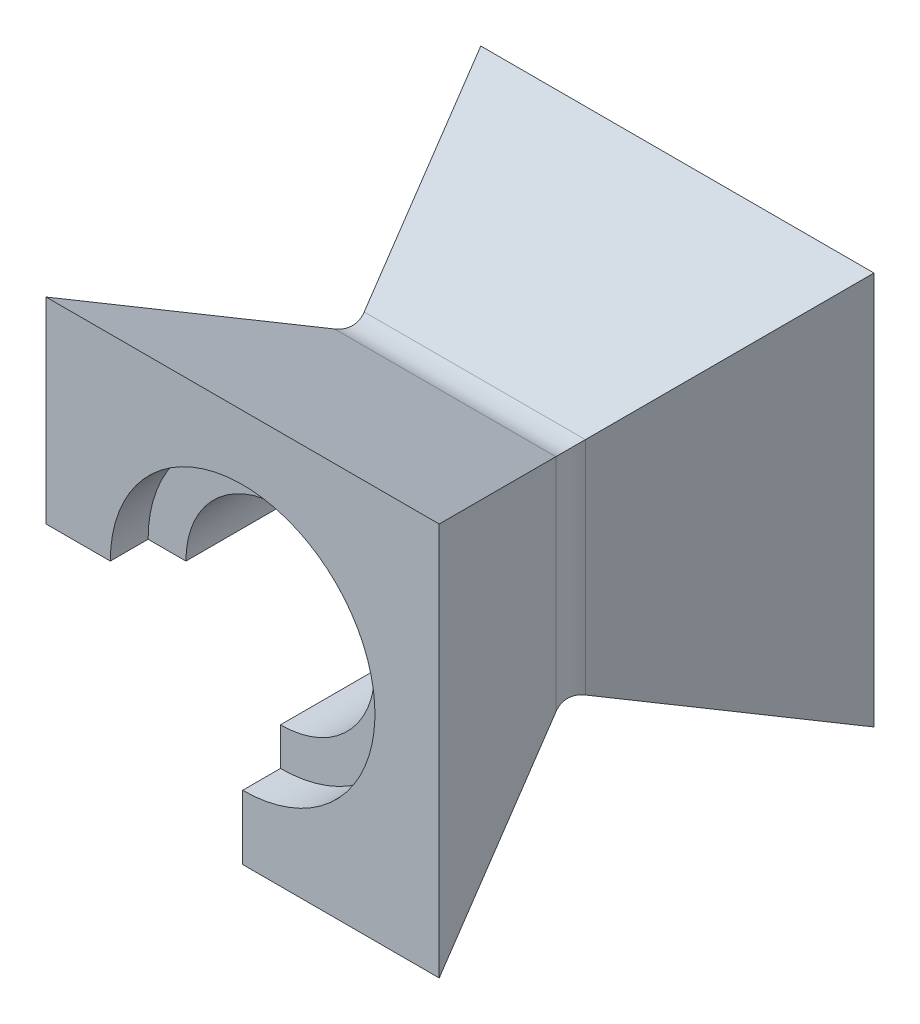
ISO-10303-21;
HEADER;
FILE_DESCRIPTION(('STEP AP214'),'2;1');
FILE_NAME('part.step','',(''),(''),'','','');
FILE_SCHEMA(('AUTOMOTIVE_DESIGN { 1 0 10303 214 1 1 1 1 }'));
ENDSEC;
DATA;
#1=APPLICATION_CONTEXT('core data for automotive mechanical design processes');
#2=APPLICATION_PROTOCOL_DEFINITION('international standard','automotive_design',2000,#1);
#3=PRODUCT_CONTEXT('',#1,'mechanical');
#4=PRODUCT('Part','Part','',(#3));
#5=PRODUCT_RELATED_PRODUCT_CATEGORY('part','',(#4));
#6=PRODUCT_DEFINITION_FORMATION('','',#4);
#7=PRODUCT_DEFINITION_CONTEXT('part definition',#1,'design');
#8=PRODUCT_DEFINITION('design','',#6,#7);
#9=PRODUCT_DEFINITION_SHAPE('','',#8);
#10=(LENGTH_UNIT() NAMED_UNIT(*) SI_UNIT(.MILLI.,.METRE.));
#11=(NAMED_UNIT(*) PLANE_ANGLE_UNIT() SI_UNIT($,.RADIAN.));
#12=(NAMED_UNIT(*) SI_UNIT($,.STERADIAN.) SOLID_ANGLE_UNIT());
#13=UNCERTAINTY_MEASURE_WITH_UNIT(LENGTH_MEASURE(1.E-05),#10,'distance_accuracy_value','');
#14=(GEOMETRIC_REPRESENTATION_CONTEXT(3) GLOBAL_UNCERTAINTY_ASSIGNED_CONTEXT((#13)) GLOBAL_UNIT_ASSIGNED_CONTEXT((#10,
#11,#12)) REPRESENTATION_CONTEXT('',''));
#15=CARTESIAN_POINT('',(0.,0.,0.));
#16=DIRECTION('',(0.,0.,1.));
#17=DIRECTION('',(1.,0.,0.));
#18=AXIS2_PLACEMENT_3D('',#15,#16,#17);
#19=CARTESIAN_POINT('',(0.,0.,115.));
#20=DIRECTION('',(0.,0.,-1.));
#21=DIRECTION('',(-1.,0.,0.));
#22=AXIS2_PLACEMENT_3D('',#19,#20,#21);
#23=CYLINDRICAL_SURFACE('',#22,25.);
#24=DIRECTION('',(0.,0.,-1.));
#25=VECTOR('',#24,1.);
#26=CARTESIAN_POINT('',(-25.,0.,115.));
#27=LINE('',#26,#25);
#28=CARTESIAN_POINT('',(-25.,0.,9.99999999999999));
#29=VERTEX_POINT('',#28);
#30=CARTESIAN_POINT('',(-25.,0.,105.));
#31=VERTEX_POINT('',#30);
#32=EDGE_CURVE('E196',#29,#31,#27,.F.);
#33=ORIENTED_EDGE('',*,*,#32,.F.);
#34=CARTESIAN_POINT('',(0.,0.,9.99999999999999));
#35=DIRECTION('',(0.,0.,-1.));
#36=DIRECTION('',(-1.,0.,0.));
#37=AXIS2_PLACEMENT_3D('',#34,#35,#36);
#38=CIRCLE('',#37,25.);
#39=CARTESIAN_POINT('',(0.,-25.,9.99999999999999));
#40=VERTEX_POINT('',#39);
#41=EDGE_CURVE('E317',#29,#40,#38,.T.);
#42=ORIENTED_EDGE('',*,*,#41,.T.);
#43=DIRECTION('',(0.,0.,-1.));
#44=VECTOR('',#43,1.);
#45=CARTESIAN_POINT('',(0.,-25.,115.));
#46=LINE('',#45,#44);
#47=CARTESIAN_POINT('',(0.,-25.,105.));
#48=VERTEX_POINT('',#47);
#49=EDGE_CURVE('E203',#48,#40,#46,.T.);
#50=ORIENTED_EDGE('',*,*,#49,.F.);
#51=CARTESIAN_POINT('',(0.,0.,105.));
#52=DIRECTION('',(0.,0.,1.));
#53=DIRECTION('',(1.,0.,0.));
#54=AXIS2_PLACEMENT_3D('',#51,#52,#53);
#55=CIRCLE('',#54,25.);
#56=EDGE_CURVE('E68',#48,#31,#55,.T.);
#57=ORIENTED_EDGE('',*,*,#56,.T.);
#58=EDGE_LOOP('',(#33,#42,#50,#57));
#59=FACE_BOUND('',#58,.T.);
#60=ADVANCED_FACE('F44',(#59),#23,.F.);
#61=CARTESIAN_POINT('',(0.,0.,115.));
#62=DIRECTION('',(0.,0.,1.));
#63=DIRECTION('',(1.,0.,0.));
#64=AXIS2_PLACEMENT_3D('',#61,#62,#63);
#65=PLANE('',#64);
#66=CARTESIAN_POINT('',(0.,0.,115.));
#67=DIRECTION('',(0.,0.,1.));
#68=DIRECTION('',(1.,0.,0.));
#69=AXIS2_PLACEMENT_3D('',#66,#67,#68);
#70=CIRCLE('',#69,35.);
#71=CARTESIAN_POINT('',(0.,-35.,115.));
#72=VERTEX_POINT('',#71);
#73=CARTESIAN_POINT('',(-35.,0.,115.));
#74=VERTEX_POINT('',#73);
#75=EDGE_CURVE('E166',#72,#74,#70,.T.);
#76=ORIENTED_EDGE('',*,*,#75,.F.);
#77=DIRECTION('',(0.,-1.,0.));
#78=VECTOR('',#77,1.);
#79=CARTESIAN_POINT('',(0.,-61.3662230104889,115.));
#80=LINE('',#79,#78);
#81=CARTESIAN_POINT('',(0.,-52.,115.));
#82=VERTEX_POINT('',#81);
#83=EDGE_CURVE('E184',#72,#82,#80,.T.);
#84=ORIENTED_EDGE('',*,*,#83,.T.);
#85=DIRECTION('',(1.,0.,0.));
#86=VECTOR('',#85,1.);
#87=CARTESIAN_POINT('',(52.,-52.,115.));
#88=LINE('',#87,#86);
#89=CARTESIAN_POINT('',(52.,-52.,115.));
#90=VERTEX_POINT('',#89);
#91=EDGE_CURVE('E226',#82,#90,#88,.T.);
#92=ORIENTED_EDGE('',*,*,#91,.T.);
#93=DIRECTION('',(0.,1.,0.));
#94=VECTOR('',#93,1.);
#95=CARTESIAN_POINT('',(52.,-52.,115.));
#96=LINE('',#95,#94);
#97=CARTESIAN_POINT('',(52.,52.,115.));
#98=VERTEX_POINT('',#97);
#99=EDGE_CURVE('E231',#90,#98,#96,.T.);
#100=ORIENTED_EDGE('',*,*,#99,.T.);
#101=DIRECTION('',(-1.,0.,0.));
#102=VECTOR('',#101,1.);
#103=CARTESIAN_POINT('',(52.,52.,115.));
#104=LINE('',#103,#102);
#105=CARTESIAN_POINT('',(-52.,52.,115.));
#106=VERTEX_POINT('',#105);
#107=EDGE_CURVE('E235',#98,#106,#104,.T.);
#108=ORIENTED_EDGE('',*,*,#107,.T.);
#109=DIRECTION('',(0.,-1.,0.));
#110=VECTOR('',#109,1.);
#111=CARTESIAN_POINT('',(-52.,-52.,115.));
#112=LINE('',#111,#110);
#113=CARTESIAN_POINT('',(-52.,0.,115.));
#114=VERTEX_POINT('',#113);
#115=EDGE_CURVE('E222',#106,#114,#112,.T.);
#116=ORIENTED_EDGE('',*,*,#115,.T.);
#117=DIRECTION('',(1.,0.,0.));
#118=VECTOR('',#117,1.);
#119=CARTESIAN_POINT('',(0.,0.,115.));
#120=LINE('',#119,#118);
#121=EDGE_CURVE('E188',#114,#74,#120,.T.);
#122=ORIENTED_EDGE('',*,*,#121,.T.);
#123=EDGE_LOOP('',(#76,#84,#92,#100,#108,#116,#122));
#124=FACE_BOUND('',#123,.T.);
#125=ADVANCED_FACE('F351',(#124),#65,.T.);
#126=CARTESIAN_POINT('',(0.,0.,0.));
#127=DIRECTION('',(0.,0.,1.));
#128=DIRECTION('',(1.,0.,0.));
#129=AXIS2_PLACEMENT_3D('',#126,#127,#128);
#130=PLANE('',#129);
#131=DIRECTION('',(0.,-1.,0.));
#132=VECTOR('',#131,1.);
#133=CARTESIAN_POINT('',(0.,-61.3662230104889,0.));
#134=LINE('',#133,#132);
#135=CARTESIAN_POINT('',(0.,-35.,0.));
#136=VERTEX_POINT('',#135);
#137=CARTESIAN_POINT('',(0.,-52.,0.));
#138=VERTEX_POINT('',#137);
#139=EDGE_CURVE('E177',#136,#138,#134,.T.);
#140=ORIENTED_EDGE('',*,*,#139,.F.);
#141=CARTESIAN_POINT('',(0.,0.,0.));
#142=DIRECTION('',(0.,0.,-1.));
#143=DIRECTION('',(-1.,0.,0.));
#144=AXIS2_PLACEMENT_3D('',#141,#142,#143);
#145=CIRCLE('',#144,35.);
#146=CARTESIAN_POINT('',(-35.,0.,0.));
#147=VERTEX_POINT('',#146);
#148=EDGE_CURVE('E161',#147,#136,#145,.T.);
#149=ORIENTED_EDGE('',*,*,#148,.F.);
#150=DIRECTION('',(1.,0.,0.));
#151=VECTOR('',#150,1.);
#152=CARTESIAN_POINT('',(0.,0.,0.));
#153=LINE('',#152,#151);
#154=CARTESIAN_POINT('',(-52.,0.,0.));
#155=VERTEX_POINT('',#154);
#156=EDGE_CURVE('E174',#155,#147,#153,.T.);
#157=ORIENTED_EDGE('',*,*,#156,.F.);
#158=DIRECTION('',(0.,-1.,0.));
#159=VECTOR('',#158,1.);
#160=CARTESIAN_POINT('',(-52.,-52.,0.));
#161=LINE('',#160,#159);
#162=CARTESIAN_POINT('',(-52.,52.,0.));
#163=VERTEX_POINT('',#162);
#164=EDGE_CURVE('E221',#163,#155,#161,.T.);
#165=ORIENTED_EDGE('',*,*,#164,.F.);
#166=DIRECTION('',(-1.,0.,0.));
#167=VECTOR('',#166,1.);
#168=CARTESIAN_POINT('',(52.,52.,0.));
#169=LINE('',#168,#167);
#170=CARTESIAN_POINT('',(52.,52.,0.));
#171=VERTEX_POINT('',#170);
#172=EDGE_CURVE('E227',#171,#163,#169,.T.);
#173=ORIENTED_EDGE('',*,*,#172,.F.);
#174=DIRECTION('',(0.,1.,0.));
#175=VECTOR('',#174,1.);
#176=CARTESIAN_POINT('',(52.,-52.,0.));
#177=LINE('',#176,#175);
#178=CARTESIAN_POINT('',(52.,-52.,0.));
#179=VERTEX_POINT('',#178);
#180=EDGE_CURVE('E245',#179,#171,#177,.T.);
#181=ORIENTED_EDGE('',*,*,#180,.F.);
#182=DIRECTION('',(1.,0.,0.));
#183=VECTOR('',#182,1.);
#184=CARTESIAN_POINT('',(52.,-52.,0.));
#185=LINE('',#184,#183);
#186=EDGE_CURVE('E242',#138,#179,#185,.T.);
#187=ORIENTED_EDGE('',*,*,#186,.F.);
#188=EDGE_LOOP('',(#140,#149,#157,#165,#173,#181,#187));
#189=FACE_BOUND('',#188,.T.);
#190=ADVANCED_FACE('F172',(#189),#130,.F.);
#191=CARTESIAN_POINT('',(63.,27.5926980679481,57.5));
#192=DIRECTION('',(0.,-0.920504853452443,-0.390731128489268));
#193=DIRECTION('',(0.,0.390731128489268,-0.920504853452443));
#194=AXIS2_PLACEMENT_3D('',#191,#192,#193);
#195=PLANE('',#194);
#196=DIRECTION('',(0.363936289648104,-0.363936289648097,0.857380168976603));
#197=VECTOR('',#196,1.);
#198=CARTESIAN_POINT('',(-15.5937293692863,15.593729369287,85.7677987961864));
#199=LINE('',#198,#197);
#200=CARTESIAN_POINT('',(-29.2512533074762,29.2512533074766,53.5926887151073));
#201=VERTEX_POINT('',#200);
#202=EDGE_CURVE('E217',#163,#201,#199,.T.);
#203=ORIENTED_EDGE('',*,*,#202,.T.);
#204=DIRECTION('',(-1.,0.,0.));
#205=VECTOR('',#204,1.);
#206=CARTESIAN_POINT('',(27.5926980679477,29.2512533074766,53.5926887151073));
#207=LINE('',#206,#205);
#208=CARTESIAN_POINT('',(29.2512533074762,29.2512533074766,53.5926887151073));
#209=VERTEX_POINT('',#208);
#210=EDGE_CURVE('E275',#201,#209,#207,.F.);
#211=ORIENTED_EDGE('',*,*,#210,.T.);
#212=DIRECTION('',(0.363936289648104,0.363936289648097,-0.857380168976603));
#213=VECTOR('',#212,1.);
#214=CARTESIAN_POINT('',(32.2823818575627,32.2823818575631,46.45179734927));
#215=LINE('',#214,#213);
#216=EDGE_CURVE('E214',#209,#171,#215,.T.);
#217=ORIENTED_EDGE('',*,*,#216,.T.);
#218=ORIENTED_EDGE('',*,*,#172,.T.);
#219=EDGE_LOOP('',(#203,#211,#217,#218));
#220=FACE_BOUND('',#219,.T.);
#221=ADVANCED_FACE('F368',(#220),#195,.F.);
#222=CARTESIAN_POINT('',(63.,52.,115.));
#223=DIRECTION('',(0.,-0.920504853452443,0.390731128489268));
#224=DIRECTION('',(0.,-0.390731128489268,-0.920504853452443));
#225=AXIS2_PLACEMENT_3D('',#222,#223,#224);
#226=PLANE('',#225);
#227=DIRECTION('',(-0.363936289648104,-0.363936289648097,-0.857380168976603));
#228=VECTOR('',#227,1.);
#229=CARTESIAN_POINT('',(53.4569458521511,53.4569458521511,118.432349332667));
#230=LINE('',#229,#228);
#231=CARTESIAN_POINT('',(29.2512533074762,29.2512533074767,61.4073112848927));
#232=VERTEX_POINT('',#231);
#233=EDGE_CURVE('E207',#98,#232,#230,.T.);
#234=ORIENTED_EDGE('',*,*,#233,.T.);
#235=DIRECTION('',(-1.,0.,0.));
#236=VECTOR('',#235,1.);
#237=CARTESIAN_POINT('',(-27.5926980679476,29.2512533074766,61.4073112848927));
#238=LINE('',#237,#236);
#239=CARTESIAN_POINT('',(-29.2512533074762,29.2512533074766,61.4073112848927));
#240=VERTEX_POINT('',#239);
#241=EDGE_CURVE('E272',#232,#240,#238,.T.);
#242=ORIENTED_EDGE('',*,*,#241,.T.);
#243=DIRECTION('',(-0.363936289648104,0.363936289648097,0.857380168976603));
#244=VECTOR('',#243,1.);
#245=CARTESIAN_POINT('',(-36.7682933638747,36.768293363875,79.1163478857509));
#246=LINE('',#245,#244);
#247=EDGE_CURVE('E211',#240,#106,#246,.T.);
#248=ORIENTED_EDGE('',*,*,#247,.T.);
#249=ORIENTED_EDGE('',*,*,#107,.F.);
#250=EDGE_LOOP('',(#234,#242,#248,#249));
#251=FACE_BOUND('',#250,.T.);
#252=ADVANCED_FACE('F395',(#251),#226,.F.);
#253=CARTESIAN_POINT('',(63.,-27.5926980679481,57.5));
#254=DIRECTION('',(0.,0.920504853452443,-0.390731128489268));
#255=DIRECTION('',(0.,0.390731128489268,0.920504853452443));
#256=AXIS2_PLACEMENT_3D('',#253,#254,#255);
#257=PLANE('',#256);
#258=DIRECTION('',(-0.363936289648104,0.363936289648097,0.857380168976603));
#259=VECTOR('',#258,1.);
#260=CARTESIAN_POINT('',(32.2823818575627,-32.2823818575631,46.45179734927));
#261=LINE('',#260,#259);
#262=CARTESIAN_POINT('',(29.2512533074762,-29.2512533074766,53.5926887151073));
#263=VERTEX_POINT('',#262);
#264=EDGE_CURVE('E254',#179,#263,#261,.T.);
#265=ORIENTED_EDGE('',*,*,#264,.T.);
#266=DIRECTION('',(-1.,0.,0.));
#267=VECTOR('',#266,1.);
#268=CARTESIAN_POINT('',(0.,-29.2512533074766,53.5926887151073));
#269=LINE('',#268,#267);
#270=CARTESIAN_POINT('',(0.,-29.2512533074766,53.5926887151073));
#271=VERTEX_POINT('',#270);
#272=EDGE_CURVE('E284',#263,#271,#269,.T.);
#273=ORIENTED_EDGE('',*,*,#272,.T.);
#274=DIRECTION('',(0.,-0.390731128489268,-0.920504853452443));
#275=VECTOR('',#274,1.);
#276=CARTESIAN_POINT('',(0.,-27.5926980679481,57.5));
#277=LINE('',#276,#275);
#278=EDGE_CURVE('E199',#271,#138,#277,.T.);
#279=ORIENTED_EDGE('',*,*,#278,.T.);
#280=ORIENTED_EDGE('',*,*,#186,.T.);
#281=EDGE_LOOP('',(#265,#273,#279,#280));
#282=FACE_BOUND('',#281,.T.);
#283=ADVANCED_FACE('F378',(#282),#257,.F.);
#284=CARTESIAN_POINT('',(63.,-52.,115.));
#285=DIRECTION('',(0.,0.920504853452443,0.390731128489268));
#286=DIRECTION('',(0.,-0.390731128489268,0.920504853452443));
#287=AXIS2_PLACEMENT_3D('',#284,#285,#286);
#288=PLANE('',#287);
#289=DIRECTION('',(0.,0.390731128489268,-0.920504853452443));
#290=VECTOR('',#289,1.);
#291=CARTESIAN_POINT('',(0.,-52.,115.));
#292=LINE('',#291,#290);
#293=CARTESIAN_POINT('',(0.,-29.2512533074766,61.4073112848926));
#294=VERTEX_POINT('',#293);
#295=EDGE_CURVE('E261',#82,#294,#292,.T.);
#296=ORIENTED_EDGE('',*,*,#295,.T.);
#297=DIRECTION('',(-1.,0.,0.));
#298=VECTOR('',#297,1.);
#299=CARTESIAN_POINT('',(27.5926980679477,-29.2512533074766,61.4073112848927));
#300=LINE('',#299,#298);
#301=CARTESIAN_POINT('',(29.2512533074762,-29.2512533074766,61.4073112848927));
#302=VERTEX_POINT('',#301);
#303=EDGE_CURVE('E287',#294,#302,#300,.F.);
#304=ORIENTED_EDGE('',*,*,#303,.T.);
#305=DIRECTION('',(0.363936289648104,-0.363936289648097,0.857380168976602));
#306=VECTOR('',#305,1.);
#307=CARTESIAN_POINT('',(53.4569458521511,-53.4569458521511,118.432349332667));
#308=LINE('',#307,#306);
#309=EDGE_CURVE('E239',#302,#90,#308,.T.);
#310=ORIENTED_EDGE('',*,*,#309,.T.);
#311=ORIENTED_EDGE('',*,*,#91,.F.);
#312=EDGE_LOOP('',(#296,#304,#310,#311));
#313=FACE_BOUND('',#312,.T.);
#314=ADVANCED_FACE('F400',(#313),#288,.F.);
#315=CARTESIAN_POINT('',(52.,-63.,0.));
#316=DIRECTION('',(-0.92050485345244,0.,-0.390731128489275));
#317=DIRECTION('',(-0.390731128489275,0.,0.92050485345244));
#318=AXIS2_PLACEMENT_3D('',#315,#316,#317);
#319=PLANE('',#318);
#320=ORIENTED_EDGE('',*,*,#216,.F.);
#321=DIRECTION('',(0.,1.,0.));
#322=VECTOR('',#321,1.);
#323=CARTESIAN_POINT('',(29.2512533074762,-27.5926980679481,53.5926887151073));
#324=LINE('',#323,#322);
#325=EDGE_CURVE('E281',#209,#263,#324,.F.);
#326=ORIENTED_EDGE('',*,*,#325,.T.);
#327=ORIENTED_EDGE('',*,*,#264,.F.);
#328=ORIENTED_EDGE('',*,*,#180,.T.);
#329=EDGE_LOOP('',(#320,#326,#327,#328));
#330=FACE_BOUND('',#329,.T.);
#331=ADVANCED_FACE('F374',(#330),#319,.F.);
#332=CARTESIAN_POINT('',(52.,-63.,115.));
#333=DIRECTION('',(-0.92050485345244,0.,0.390731128489275));
#334=DIRECTION('',(0.390731128489275,0.,0.92050485345244));
#335=AXIS2_PLACEMENT_3D('',#332,#333,#334);
#336=PLANE('',#335);
#337=ORIENTED_EDGE('',*,*,#309,.F.);
#338=DIRECTION('',(0.,1.,0.));
#339=VECTOR('',#338,1.);
#340=CARTESIAN_POINT('',(29.2512533074762,27.5926980679481,61.4073112848927));
#341=LINE('',#340,#339);
#342=EDGE_CURVE('E278',#302,#232,#341,.T.);
#343=ORIENTED_EDGE('',*,*,#342,.T.);
#344=ORIENTED_EDGE('',*,*,#233,.F.);
#345=ORIENTED_EDGE('',*,*,#99,.F.);
#346=EDGE_LOOP('',(#337,#343,#344,#345));
#347=FACE_BOUND('',#346,.T.);
#348=ADVANCED_FACE('F391',(#347),#336,.F.);
#349=CARTESIAN_POINT('',(-52.,-63.,0.));
#350=DIRECTION('',(0.92050485345244,0.,-0.390731128489275));
#351=DIRECTION('',(-0.390731128489275,0.,-0.92050485345244));
#352=AXIS2_PLACEMENT_3D('',#349,#350,#351);
#353=PLANE('',#352);
#354=DIRECTION('',(0.390731128489275,0.,0.92050485345244));
#355=VECTOR('',#354,1.);
#356=CARTESIAN_POINT('',(-52.,0.,0.));
#357=LINE('',#356,#355);
#358=CARTESIAN_POINT('',(-29.2512533074762,0.,53.5926887151073));
#359=VERTEX_POINT('',#358);
#360=EDGE_CURVE('E182',#155,#359,#357,.T.);
#361=ORIENTED_EDGE('',*,*,#360,.T.);
#362=DIRECTION('',(0.,1.,0.));
#363=VECTOR('',#362,1.);
#364=CARTESIAN_POINT('',(-29.2512533074762,27.5926980679481,53.5926887151073));
#365=LINE('',#364,#363);
#366=EDGE_CURVE('E265',#359,#201,#365,.T.);
#367=ORIENTED_EDGE('',*,*,#366,.T.);
#368=ORIENTED_EDGE('',*,*,#202,.F.);
#369=ORIENTED_EDGE('',*,*,#164,.T.);
#370=EDGE_LOOP('',(#361,#367,#368,#369));
#371=FACE_BOUND('',#370,.T.);
#372=ADVANCED_FACE('F366',(#371),#353,.F.);
#373=CARTESIAN_POINT('',(-52.,-63.,115.));
#374=DIRECTION('',(0.92050485345244,0.,0.390731128489275));
#375=DIRECTION('',(0.390731128489275,0.,-0.92050485345244));
#376=AXIS2_PLACEMENT_3D('',#373,#374,#375);
#377=PLANE('',#376);
#378=ORIENTED_EDGE('',*,*,#247,.F.);
#379=DIRECTION('',(0.,1.,0.));
#380=VECTOR('',#379,1.);
#381=CARTESIAN_POINT('',(-29.2512533074762,0.,61.4073112848927));
#382=LINE('',#381,#380);
#383=CARTESIAN_POINT('',(-29.2512533074762,0.,61.4073112848927));
#384=VERTEX_POINT('',#383);
#385=EDGE_CURVE('E269',#240,#384,#382,.F.);
#386=ORIENTED_EDGE('',*,*,#385,.T.);
#387=DIRECTION('',(-0.390731128489275,0.,0.92050485345244));
#388=VECTOR('',#387,1.);
#389=CARTESIAN_POINT('',(-52.,0.,115.));
#390=LINE('',#389,#388);
#391=EDGE_CURVE('E258',#384,#114,#390,.T.);
#392=ORIENTED_EDGE('',*,*,#391,.T.);
#393=ORIENTED_EDGE('',*,*,#115,.F.);
#394=EDGE_LOOP('',(#378,#386,#392,#393));
#395=FACE_BOUND('',#394,.T.);
#396=ADVANCED_FACE('F437',(#395),#377,.F.);
#397=CARTESIAN_POINT('',(0.,0.,115.));
#398=DIRECTION('',(0.,1.,0.));
#399=DIRECTION('',(0.,0.,1.));
#400=AXIS2_PLACEMENT_3D('',#397,#398,#399);
#401=PLANE('',#400);
#402=ORIENTED_EDGE('',*,*,#156,.T.);
#403=DIRECTION('',(0.,0.,-1.));
#404=VECTOR('',#403,1.);
#405=CARTESIAN_POINT('',(-35.,0.,10.));
#406=LINE('',#405,#404);
#407=CARTESIAN_POINT('',(-35.,0.,10.));
#408=VERTEX_POINT('',#407);
#409=EDGE_CURVE('E158',#147,#408,#406,.F.);
#410=ORIENTED_EDGE('',*,*,#409,.T.);
#411=DIRECTION('',(-1.,0.,0.));
#412=VECTOR('',#411,1.);
#413=CARTESIAN_POINT('',(0.,0.,9.99999999999999));
#414=LINE('',#413,#412);
#415=EDGE_CURVE('E167',#29,#408,#414,.T.);
#416=ORIENTED_EDGE('',*,*,#415,.F.);
#417=ORIENTED_EDGE('',*,*,#32,.T.);
#418=DIRECTION('',(1.,0.,0.));
#419=VECTOR('',#418,1.);
#420=CARTESIAN_POINT('',(0.,0.,105.));
#421=LINE('',#420,#419);
#422=CARTESIAN_POINT('',(-35.,0.,105.));
#423=VERTEX_POINT('',#422);
#424=EDGE_CURVE('E339',#423,#31,#421,.T.);
#425=ORIENTED_EDGE('',*,*,#424,.F.);
#426=DIRECTION('',(0.,0.,1.));
#427=VECTOR('',#426,1.);
#428=CARTESIAN_POINT('',(-35.,0.,105.));
#429=LINE('',#428,#427);
#430=EDGE_CURVE('E301',#423,#74,#429,.T.);
#431=ORIENTED_EDGE('',*,*,#430,.T.);
#432=ORIENTED_EDGE('',*,*,#121,.F.);
#433=ORIENTED_EDGE('',*,*,#391,.F.);
#434=CARTESIAN_POINT('',(-38.4563018420006,0.,57.5));
#435=DIRECTION('',(0.,1.,0.));
#436=DIRECTION('',(0.,0.,1.));
#437=AXIS2_PLACEMENT_3D('',#434,#435,#436);
#438=CIRCLE('',#437,10.);
#439=EDGE_CURVE('E290',#384,#359,#438,.T.);
#440=ORIENTED_EDGE('',*,*,#439,.T.);
#441=ORIENTED_EDGE('',*,*,#360,.F.);
#442=EDGE_LOOP('',(#402,#410,#416,#417,#425,#431,#432,#433,#440,#441));
#443=FACE_BOUND('',#442,.T.);
#444=ADVANCED_FACE('F180',(#443),#401,.F.);
#445=CARTESIAN_POINT('',(0.,-61.3662230104889,115.));
#446=DIRECTION('',(1.,0.,0.));
#447=DIRECTION('',(0.,0.,-1.));
#448=AXIS2_PLACEMENT_3D('',#445,#446,#447);
#449=PLANE('',#448);
#450=DIRECTION('',(0.,1.,0.));
#451=VECTOR('',#450,1.);
#452=CARTESIAN_POINT('',(0.,-61.3662230104889,9.99999999999999));
#453=LINE('',#452,#451);
#454=CARTESIAN_POINT('',(0.,-35.,9.99999999999999));
#455=VERTEX_POINT('',#454);
#456=EDGE_CURVE('E53',#455,#40,#453,.T.);
#457=ORIENTED_EDGE('',*,*,#456,.F.);
#458=DIRECTION('',(0.,0.,-1.));
#459=VECTOR('',#458,1.);
#460=CARTESIAN_POINT('',(0.,-35.,10.));
#461=LINE('',#460,#459);
#462=EDGE_CURVE('E11',#455,#136,#461,.T.);
#463=ORIENTED_EDGE('',*,*,#462,.T.);
#464=ORIENTED_EDGE('',*,*,#139,.T.);
#465=ORIENTED_EDGE('',*,*,#278,.F.);
#466=CARTESIAN_POINT('',(0.,-38.4563018420011,57.5));
#467=DIRECTION('',(1.,0.,0.));
#468=DIRECTION('',(0.,0.,-1.));
#469=AXIS2_PLACEMENT_3D('',#466,#467,#468);
#470=CIRCLE('',#469,10.);
#471=EDGE_CURVE('E293',#271,#294,#470,.T.);
#472=ORIENTED_EDGE('',*,*,#471,.T.);
#473=ORIENTED_EDGE('',*,*,#295,.F.);
#474=ORIENTED_EDGE('',*,*,#83,.F.);
#475=DIRECTION('',(0.,0.,1.));
#476=VECTOR('',#475,1.);
#477=CARTESIAN_POINT('',(0.,-35.,105.));
#478=LINE('',#477,#476);
#479=CARTESIAN_POINT('',(0.,-35.,105.));
#480=VERTEX_POINT('',#479);
#481=EDGE_CURVE('E310',#72,#480,#478,.F.);
#482=ORIENTED_EDGE('',*,*,#481,.T.);
#483=DIRECTION('',(0.,-1.,0.));
#484=VECTOR('',#483,1.);
#485=CARTESIAN_POINT('',(0.,-61.3662230104889,105.));
#486=LINE('',#485,#484);
#487=EDGE_CURVE('E296',#48,#480,#486,.T.);
#488=ORIENTED_EDGE('',*,*,#487,.F.);
#489=ORIENTED_EDGE('',*,*,#49,.T.);
#490=EDGE_LOOP('',(#457,#463,#464,#465,#472,#473,#474,#482,#488,#489));
#491=FACE_BOUND('',#490,.T.);
#492=ADVANCED_FACE('F324',(#491),#449,.F.);
#493=CARTESIAN_POINT('',(63.,-38.4563018420011,57.5));
#494=DIRECTION('',(1.,0.,0.));
#495=DIRECTION('',(0.,0.,-1.));
#496=AXIS2_PLACEMENT_3D('',#493,#494,#495);
#497=CYLINDRICAL_SURFACE('',#496,10.);
#498=ORIENTED_EDGE('',*,*,#471,.F.);
#499=ORIENTED_EDGE('',*,*,#272,.F.);
#500=CARTESIAN_POINT('',(38.4563018420006,-38.4563018420011,57.5));
#501=DIRECTION('',(0.707106781186547,0.707106781186548,0.));
#502=DIRECTION('',(0.707106781186548,-0.707106781186547,0.));
#503=AXIS2_PLACEMENT_3D('',#500,#501,#502);
#504=ELLIPSE('',#503,14.142135623731,10.);
#505=EDGE_CURVE('E190',#302,#263,#504,.F.);
#506=ORIENTED_EDGE('',*,*,#505,.F.);
#507=ORIENTED_EDGE('',*,*,#303,.F.);
#508=EDGE_LOOP('',(#498,#499,#506,#507));
#509=FACE_BOUND('',#508,.T.);
#510=ADVANCED_FACE('F46',(#509),#497,.F.);
#511=CARTESIAN_POINT('',(38.4563018420006,-63.,57.5));
#512=DIRECTION('',(0.,-1.,0.));
#513=DIRECTION('',(1.,0.,0.));
#514=AXIS2_PLACEMENT_3D('',#511,#512,#513);
#515=CYLINDRICAL_SURFACE('',#514,10.);
#516=ORIENTED_EDGE('',*,*,#505,.T.);
#517=ORIENTED_EDGE('',*,*,#325,.F.);
#518=CARTESIAN_POINT('',(38.4563018420006,38.4563018420011,57.5));
#519=DIRECTION('',(0.707106781186548,-0.707106781186547,0.));
#520=DIRECTION('',(-0.707106781186547,-0.707106781186548,0.));
#521=AXIS2_PLACEMENT_3D('',#518,#519,#520);
#522=ELLIPSE('',#521,14.1421356237309,10.);
#523=EDGE_CURVE('E300',#232,#209,#522,.T.);
#524=ORIENTED_EDGE('',*,*,#523,.F.);
#525=ORIENTED_EDGE('',*,*,#342,.F.);
#526=EDGE_LOOP('',(#516,#517,#524,#525));
#527=FACE_BOUND('',#526,.T.);
#528=ADVANCED_FACE('F386',(#527),#515,.F.);
#529=CARTESIAN_POINT('',(63.,38.4563018420011,57.5));
#530=DIRECTION('',(1.,0.,0.));
#531=DIRECTION('',(0.,0.,-1.));
#532=AXIS2_PLACEMENT_3D('',#529,#530,#531);
#533=CYLINDRICAL_SURFACE('',#532,10.);
#534=ORIENTED_EDGE('',*,*,#523,.T.);
#535=ORIENTED_EDGE('',*,*,#210,.F.);
#536=CARTESIAN_POINT('',(-38.4563018420006,38.4563018420011,57.5));
#537=DIRECTION('',(0.707106781186547,0.707106781186548,0.));
#538=DIRECTION('',(0.707106781186548,-0.707106781186547,0.));
#539=AXIS2_PLACEMENT_3D('',#536,#537,#538);
#540=ELLIPSE('',#539,14.142135623731,10.);
#541=EDGE_CURVE('E297',#240,#201,#540,.T.);
#542=ORIENTED_EDGE('',*,*,#541,.F.);
#543=ORIENTED_EDGE('',*,*,#241,.F.);
#544=EDGE_LOOP('',(#534,#535,#542,#543));
#545=FACE_BOUND('',#544,.T.);
#546=ADVANCED_FACE('F421',(#545),#533,.F.);
#547=CARTESIAN_POINT('',(-38.4563018420006,-63.,57.5));
#548=DIRECTION('',(0.,-1.,0.));
#549=DIRECTION('',(1.,0.,0.));
#550=AXIS2_PLACEMENT_3D('',#547,#548,#549);
#551=CYLINDRICAL_SURFACE('',#550,10.);
#552=ORIENTED_EDGE('',*,*,#439,.F.);
#553=ORIENTED_EDGE('',*,*,#385,.F.);
#554=ORIENTED_EDGE('',*,*,#541,.T.);
#555=ORIENTED_EDGE('',*,*,#366,.F.);
#556=EDGE_LOOP('',(#552,#553,#554,#555));
#557=FACE_BOUND('',#556,.T.);
#558=ADVANCED_FACE('F362',(#557),#551,.F.);
#559=CARTESIAN_POINT('',(0.,0.,105.));
#560=DIRECTION('',(0.,0.,1.));
#561=DIRECTION('',(1.,0.,0.));
#562=AXIS2_PLACEMENT_3D('',#559,#560,#561);
#563=CYLINDRICAL_SURFACE('',#562,35.);
#564=CARTESIAN_POINT('',(0.,0.,105.));
#565=DIRECTION('',(0.,0.,1.));
#566=DIRECTION('',(1.,0.,0.));
#567=AXIS2_PLACEMENT_3D('',#564,#565,#566);
#568=CIRCLE('',#567,35.);
#569=EDGE_CURVE('E329',#480,#423,#568,.T.);
#570=ORIENTED_EDGE('',*,*,#569,.F.);
#571=ORIENTED_EDGE('',*,*,#481,.F.);
#572=ORIENTED_EDGE('',*,*,#75,.T.);
#573=ORIENTED_EDGE('',*,*,#430,.F.);
#574=EDGE_LOOP('',(#570,#571,#572,#573));
#575=FACE_BOUND('',#574,.T.);
#576=ADVANCED_FACE('F332',(#575),#563,.F.);
#577=CARTESIAN_POINT('',(0.,0.,105.));
#578=DIRECTION('',(0.,0.,1.));
#579=DIRECTION('',(1.,0.,0.));
#580=AXIS2_PLACEMENT_3D('',#577,#578,#579);
#581=PLANE('',#580);
#582=ORIENTED_EDGE('',*,*,#424,.T.);
#583=ORIENTED_EDGE('',*,*,#56,.F.);
#584=ORIENTED_EDGE('',*,*,#487,.T.);
#585=ORIENTED_EDGE('',*,*,#569,.T.);
#586=EDGE_LOOP('',(#582,#583,#584,#585));
#587=FACE_BOUND('',#586,.T.);
#588=ADVANCED_FACE('F328',(#587),#581,.T.);
#589=CARTESIAN_POINT('',(0.,0.,10.));
#590=DIRECTION('',(0.,0.,-1.));
#591=DIRECTION('',(-1.,0.,0.));
#592=AXIS2_PLACEMENT_3D('',#589,#590,#591);
#593=CYLINDRICAL_SURFACE('',#592,35.);
#594=ORIENTED_EDGE('',*,*,#148,.T.);
#595=ORIENTED_EDGE('',*,*,#462,.F.);
#596=CARTESIAN_POINT('',(0.,0.,10.));
#597=DIRECTION('',(0.,0.,-1.));
#598=DIRECTION('',(-1.,0.,0.));
#599=AXIS2_PLACEMENT_3D('',#596,#597,#598);
#600=CIRCLE('',#599,35.);
#601=EDGE_CURVE('E60',#408,#455,#600,.T.);
#602=ORIENTED_EDGE('',*,*,#601,.F.);
#603=ORIENTED_EDGE('',*,*,#409,.F.);
#604=EDGE_LOOP('',(#594,#595,#602,#603));
#605=FACE_BOUND('',#604,.T.);
#606=ADVANCED_FACE('F160',(#605),#593,.F.);
#607=CARTESIAN_POINT('',(0.,0.,10.));
#608=DIRECTION('',(0.,0.,-1.));
#609=DIRECTION('',(-1.,0.,0.));
#610=AXIS2_PLACEMENT_3D('',#607,#608,#609);
#611=PLANE('',#610);
#612=ORIENTED_EDGE('',*,*,#415,.T.);
#613=ORIENTED_EDGE('',*,*,#601,.T.);
#614=ORIENTED_EDGE('',*,*,#456,.T.);
#615=ORIENTED_EDGE('',*,*,#41,.F.);
#616=EDGE_LOOP('',(#612,#613,#614,#615));
#617=FACE_BOUND('',#616,.T.);
#618=ADVANCED_FACE('F316',(#617),#611,.T.);
#619=CLOSED_SHELL('',(#60,#125,#190,#221,#252,#283,#314,#331,#348,#372,#396,#444,#492,#510,#528,
#546,#558,#576,#588,#606,#618));
#620=MANIFOLD_SOLID_BREP('B2',#619);
#621=ADVANCED_BREP_SHAPE_REPRESENTATION('',(#18,#620),#14);
#622=SHAPE_DEFINITION_REPRESENTATION(#9,#621);
ENDSEC;
END-ISO-10303-21;
